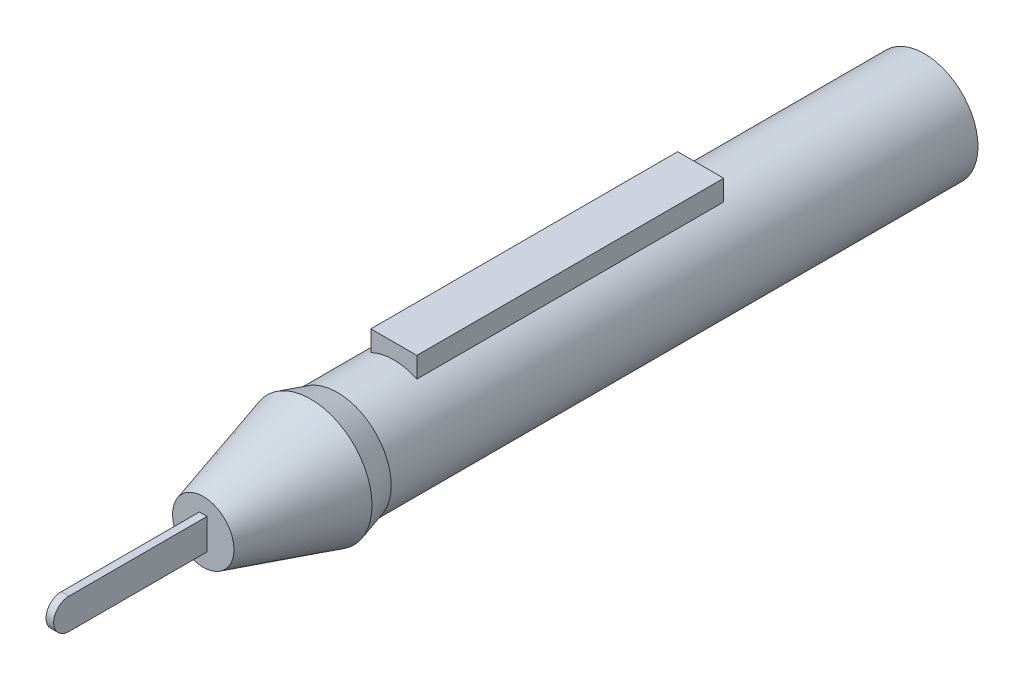
ISO-10303-21;
HEADER;
FILE_DESCRIPTION(('STEP AP214'),'2;1');
FILE_NAME('part.step','',(''),(''),'','','');
FILE_SCHEMA(('AUTOMOTIVE_DESIGN { 1 0 10303 214 1 1 1 1 }'));
ENDSEC;
DATA;
#1=APPLICATION_CONTEXT('core data for automotive mechanical design processes');
#2=APPLICATION_PROTOCOL_DEFINITION('international standard','automotive_design',2000,#1);
#3=PRODUCT_CONTEXT('',#1,'mechanical');
#4=PRODUCT('Part','Part','',(#3));
#5=PRODUCT_RELATED_PRODUCT_CATEGORY('part','',(#4));
#6=PRODUCT_DEFINITION_FORMATION('','',#4);
#7=PRODUCT_DEFINITION_CONTEXT('part definition',#1,'design');
#8=PRODUCT_DEFINITION('design','',#6,#7);
#9=PRODUCT_DEFINITION_SHAPE('','',#8);
#10=(LENGTH_UNIT() NAMED_UNIT(*) SI_UNIT(.MILLI.,.METRE.));
#11=(NAMED_UNIT(*) PLANE_ANGLE_UNIT() SI_UNIT($,.RADIAN.));
#12=(NAMED_UNIT(*) SI_UNIT($,.STERADIAN.) SOLID_ANGLE_UNIT());
#13=UNCERTAINTY_MEASURE_WITH_UNIT(LENGTH_MEASURE(1.E-05),#10,'distance_accuracy_value','');
#14=(GEOMETRIC_REPRESENTATION_CONTEXT(3) GLOBAL_UNCERTAINTY_ASSIGNED_CONTEXT((#13)) GLOBAL_UNIT_ASSIGNED_CONTEXT((#10,
#11,#12)) REPRESENTATION_CONTEXT('',''));
#15=CARTESIAN_POINT('',(0.,0.,0.));
#16=DIRECTION('',(0.,0.,1.));
#17=DIRECTION('',(1.,0.,0.));
#18=AXIS2_PLACEMENT_3D('',#15,#16,#17);
#19=CARTESIAN_POINT('',(0.,0.,-20.));
#20=DIRECTION('',(0.,0.,1.));
#21=DIRECTION('',(1.,0.,0.));
#22=AXIS2_PLACEMENT_3D('',#19,#20,#21);
#23=CYLINDRICAL_SURFACE('',#22,6.99807693751956);
#24=CARTESIAN_POINT('',(0.,0.,-114.));
#25=DIRECTION('',(0.,0.,1.));
#26=DIRECTION('',(1.,0.,0.));
#27=AXIS2_PLACEMENT_3D('',#24,#25,#26);
#28=CIRCLE('',#27,6.99807693751956);
#29=CARTESIAN_POINT('',(6.99807693751956,0.,-114.));
#30=VERTEX_POINT('',#29);
#31=EDGE_CURVE('E115',#30,#30,#28,.T.);
#32=ORIENTED_EDGE('',*,*,#31,.T.);
#33=EDGE_LOOP('',(#32));
#34=FACE_BOUND('',#33,.T.);
#35=CARTESIAN_POINT('',(0.,0.,-37.4950761371872));
#36=DIRECTION('',(0.,0.,1.));
#37=DIRECTION('',(1.,0.,0.));
#38=AXIS2_PLACEMENT_3D('',#35,#36,#37);
#39=CIRCLE('',#38,6.99807693751957);
#40=CARTESIAN_POINT('',(6.99807693751957,0.,-37.4950761371872));
#41=VERTEX_POINT('',#40);
#42=EDGE_CURVE('E118',#41,#41,#39,.T.);
#43=ORIENTED_EDGE('',*,*,#42,.F.);
#44=EDGE_LOOP('',(#43));
#45=FACE_BOUND('',#44,.T.);
#46=DIRECTION('',(0.,0.,1.));
#47=VECTOR('',#46,1.);
#48=CARTESIAN_POINT('',(-3.00000000000001,6.32242681439992,-20.));
#49=LINE('',#48,#47);
#50=CARTESIAN_POINT('',(-3.,6.32242681439993,-84.8472912605064));
#51=VERTEX_POINT('',#50);
#52=CARTESIAN_POINT('',(-3.,6.32242681439993,-44.8472912605064));
#53=VERTEX_POINT('',#52);
#54=EDGE_CURVE('E11',#51,#53,#49,.T.);
#55=ORIENTED_EDGE('',*,*,#54,.F.);
#56=CARTESIAN_POINT('',(0.,0.,-84.8472912605064));
#57=DIRECTION('',(0.,0.,1.));
#58=DIRECTION('',(1.,0.,0.));
#59=AXIS2_PLACEMENT_3D('',#56,#57,#58);
#60=CIRCLE('',#59,6.99807693751956);
#61=CARTESIAN_POINT('',(3.,6.32242681439993,-84.8472912605064));
#62=VERTEX_POINT('',#61);
#63=EDGE_CURVE('E163',#62,#51,#60,.T.);
#64=ORIENTED_EDGE('',*,*,#63,.F.);
#65=DIRECTION('',(0.,0.,1.));
#66=VECTOR('',#65,1.);
#67=CARTESIAN_POINT('',(3.00000000000001,6.32242681439992,-20.));
#68=LINE('',#67,#66);
#69=CARTESIAN_POINT('',(3.00000000000001,6.32242681439992,-44.8472912605064));
#70=VERTEX_POINT('',#69);
#71=EDGE_CURVE('E51',#70,#62,#68,.F.);
#72=ORIENTED_EDGE('',*,*,#71,.F.);
#73=CARTESIAN_POINT('',(0.,0.,-44.8472912605064));
#74=DIRECTION('',(0.,0.,-1.));
#75=DIRECTION('',(-1.,0.,0.));
#76=AXIS2_PLACEMENT_3D('',#73,#74,#75);
#77=CIRCLE('',#76,6.99807693751956);
#78=EDGE_CURVE('E41',#53,#70,#77,.T.);
#79=ORIENTED_EDGE('',*,*,#78,.F.);
#80=EDGE_LOOP('',(#55,#64,#72,#79));
#81=FACE_BOUND('',#80,.T.);
#82=ADVANCED_FACE('F33',(#34,#45,#81),#23,.T.);
#83=CARTESIAN_POINT('',(0.5,0.,-2.));
#84=DIRECTION('',(-1.,0.,0.));
#85=DIRECTION('',(0.,0.,1.));
#86=AXIS2_PLACEMENT_3D('',#83,#84,#85);
#87=CYLINDRICAL_SURFACE('',#86,2.);
#88=CARTESIAN_POINT('',(-0.5,0.,-2.));
#89=DIRECTION('',(1.,0.,0.));
#90=DIRECTION('',(0.,0.,1.));
#91=AXIS2_PLACEMENT_3D('',#88,#89,#90);
#92=CIRCLE('',#91,2.);
#93=CARTESIAN_POINT('',(-0.5,2.,-2.));
#94=VERTEX_POINT('',#93);
#95=CARTESIAN_POINT('',(-0.5,-2.,-2.));
#96=VERTEX_POINT('',#95);
#97=EDGE_CURVE('E132',#94,#96,#92,.T.);
#98=ORIENTED_EDGE('',*,*,#97,.T.);
#99=DIRECTION('',(-1.,0.,0.));
#100=VECTOR('',#99,1.);
#101=CARTESIAN_POINT('',(0.5,-2.,-2.));
#102=LINE('',#101,#100);
#103=CARTESIAN_POINT('',(0.5,-2.,-2.));
#104=VERTEX_POINT('',#103);
#105=EDGE_CURVE('E160',#104,#96,#102,.T.);
#106=ORIENTED_EDGE('',*,*,#105,.F.);
#107=CARTESIAN_POINT('',(0.5,0.,-2.));
#108=DIRECTION('',(1.,0.,0.));
#109=DIRECTION('',(0.,0.,1.));
#110=AXIS2_PLACEMENT_3D('',#107,#108,#109);
#111=CIRCLE('',#110,2.);
#112=CARTESIAN_POINT('',(0.5,2.,-2.));
#113=VERTEX_POINT('',#112);
#114=EDGE_CURVE('E133',#113,#104,#111,.T.);
#115=ORIENTED_EDGE('',*,*,#114,.F.);
#116=DIRECTION('',(-1.,0.,0.));
#117=VECTOR('',#116,1.);
#118=CARTESIAN_POINT('',(0.5,2.,-2.));
#119=LINE('',#118,#117);
#120=EDGE_CURVE('E143',#113,#94,#119,.T.);
#121=ORIENTED_EDGE('',*,*,#120,.T.);
#122=EDGE_LOOP('',(#98,#106,#115,#121));
#123=FACE_BOUND('',#122,.T.);
#124=ADVANCED_FACE('F35',(#123),#87,.T.);
#125=CARTESIAN_POINT('',(0.5,-2.,-2.));
#126=DIRECTION('',(0.,1.,0.));
#127=DIRECTION('',(0.,0.,1.));
#128=AXIS2_PLACEMENT_3D('',#125,#126,#127);
#129=PLANE('',#128);
#130=DIRECTION('',(0.,0.,-1.));
#131=VECTOR('',#130,1.);
#132=CARTESIAN_POINT('',(-0.5,-2.,-2.));
#133=LINE('',#132,#131);
#134=CARTESIAN_POINT('',(-0.5,-2.,-20.));
#135=VERTEX_POINT('',#134);
#136=EDGE_CURVE('E146',#96,#135,#133,.T.);
#137=ORIENTED_EDGE('',*,*,#136,.T.);
#138=DIRECTION('',(-1.,0.,0.));
#139=VECTOR('',#138,1.);
#140=CARTESIAN_POINT('',(0.5,-2.,-20.));
#141=LINE('',#140,#139);
#142=CARTESIAN_POINT('',(0.5,-2.,-20.));
#143=VERTEX_POINT('',#142);
#144=EDGE_CURVE('E157',#143,#135,#141,.T.);
#145=ORIENTED_EDGE('',*,*,#144,.F.);
#146=DIRECTION('',(0.,0.,-1.));
#147=VECTOR('',#146,1.);
#148=CARTESIAN_POINT('',(0.5,-2.,-2.));
#149=LINE('',#148,#147);
#150=EDGE_CURVE('E136',#104,#143,#149,.T.);
#151=ORIENTED_EDGE('',*,*,#150,.F.);
#152=ORIENTED_EDGE('',*,*,#105,.T.);
#153=EDGE_LOOP('',(#137,#145,#151,#152));
#154=FACE_BOUND('',#153,.T.);
#155=ADVANCED_FACE('F184',(#154),#129,.F.);
#156=CARTESIAN_POINT('',(0.5,2.,-2.));
#157=DIRECTION('',(0.,-1.,0.));
#158=DIRECTION('',(0.,0.,-1.));
#159=AXIS2_PLACEMENT_3D('',#156,#157,#158);
#160=PLANE('',#159);
#161=DIRECTION('',(0.,0.,1.));
#162=VECTOR('',#161,1.);
#163=CARTESIAN_POINT('',(-0.5,2.,-2.));
#164=LINE('',#163,#162);
#165=CARTESIAN_POINT('',(-0.5,2.,-20.));
#166=VERTEX_POINT('',#165);
#167=EDGE_CURVE('E137',#166,#94,#164,.T.);
#168=ORIENTED_EDGE('',*,*,#167,.T.);
#169=ORIENTED_EDGE('',*,*,#120,.F.);
#170=DIRECTION('',(0.,0.,1.));
#171=VECTOR('',#170,1.);
#172=CARTESIAN_POINT('',(0.5,2.,-2.));
#173=LINE('',#172,#171);
#174=CARTESIAN_POINT('',(0.5,2.,-20.));
#175=VERTEX_POINT('',#174);
#176=EDGE_CURVE('E141',#175,#113,#173,.T.);
#177=ORIENTED_EDGE('',*,*,#176,.F.);
#178=DIRECTION('',(-1.,0.,0.));
#179=VECTOR('',#178,1.);
#180=CARTESIAN_POINT('',(0.5,2.,-20.));
#181=LINE('',#180,#179);
#182=EDGE_CURVE('E154',#175,#166,#181,.T.);
#183=ORIENTED_EDGE('',*,*,#182,.T.);
#184=EDGE_LOOP('',(#168,#169,#177,#183));
#185=FACE_BOUND('',#184,.T.);
#186=ADVANCED_FACE('F206',(#185),#160,.F.);
#187=CARTESIAN_POINT('',(0.5,0.,-2.));
#188=DIRECTION('',(-1.,0.,0.));
#189=DIRECTION('',(0.,0.,1.));
#190=AXIS2_PLACEMENT_3D('',#187,#188,#189);
#191=PLANE('',#190);
#192=ORIENTED_EDGE('',*,*,#114,.T.);
#193=ORIENTED_EDGE('',*,*,#150,.T.);
#194=DIRECTION('',(0.,1.,0.));
#195=VECTOR('',#194,1.);
#196=CARTESIAN_POINT('',(0.5,2.,-20.));
#197=LINE('',#196,#195);
#198=EDGE_CURVE('E139',#143,#175,#197,.T.);
#199=ORIENTED_EDGE('',*,*,#198,.T.);
#200=ORIENTED_EDGE('',*,*,#176,.T.);
#201=EDGE_LOOP('',(#192,#193,#199,#200));
#202=FACE_BOUND('',#201,.T.);
#203=ADVANCED_FACE('F203',(#202),#191,.F.);
#204=CARTESIAN_POINT('',(-0.5,0.,-2.));
#205=DIRECTION('',(-1.,0.,0.));
#206=DIRECTION('',(0.,0.,1.));
#207=AXIS2_PLACEMENT_3D('',#204,#205,#206);
#208=PLANE('',#207);
#209=ORIENTED_EDGE('',*,*,#97,.F.);
#210=ORIENTED_EDGE('',*,*,#167,.F.);
#211=DIRECTION('',(0.,1.,0.));
#212=VECTOR('',#211,1.);
#213=CARTESIAN_POINT('',(-0.5,2.,-20.));
#214=LINE('',#213,#212);
#215=EDGE_CURVE('E148',#135,#166,#214,.T.);
#216=ORIENTED_EDGE('',*,*,#215,.F.);
#217=ORIENTED_EDGE('',*,*,#136,.F.);
#218=EDGE_LOOP('',(#209,#210,#216,#217));
#219=FACE_BOUND('',#218,.T.);
#220=ADVANCED_FACE('F201',(#219),#208,.T.);
#221=CARTESIAN_POINT('',(0.,0.,-20.));
#222=DIRECTION('',(0.,0.,-1.));
#223=DIRECTION('',(-1.,0.,0.));
#224=AXIS2_PLACEMENT_3D('',#221,#222,#223);
#225=PLANE('',#224);
#226=CARTESIAN_POINT('',(0.,0.,-20.));
#227=DIRECTION('',(0.,0.,1.));
#228=DIRECTION('',(1.,0.,0.));
#229=AXIS2_PLACEMENT_3D('',#226,#227,#228);
#230=CIRCLE('',#229,4.);
#231=CARTESIAN_POINT('',(4.,0.,-20.));
#232=VERTEX_POINT('',#231);
#233=EDGE_CURVE('E129',#232,#232,#230,.T.);
#234=ORIENTED_EDGE('',*,*,#233,.T.);
#235=EDGE_LOOP('',(#234));
#236=FACE_BOUND('',#235,.T.);
#237=ORIENTED_EDGE('',*,*,#182,.F.);
#238=ORIENTED_EDGE('',*,*,#198,.F.);
#239=ORIENTED_EDGE('',*,*,#144,.T.);
#240=ORIENTED_EDGE('',*,*,#215,.T.);
#241=EDGE_LOOP('',(#237,#238,#239,#240));
#242=FACE_BOUND('',#241,.T.);
#243=ADVANCED_FACE('F198',(#236,#242),#225,.F.);
#244=CARTESIAN_POINT('',(0.,0.,-34.));
#245=DIRECTION('',(0.,0.,-1.));
#246=DIRECTION('',(-1.,0.,0.));
#247=AXIS2_PLACEMENT_3D('',#244,#245,#246);
#248=CONICAL_SURFACE('',#247,8.,0.278299659005111);
#249=ORIENTED_EDGE('',*,*,#233,.F.);
#250=EDGE_LOOP('',(#249));
#251=FACE_BOUND('',#250,.T.);
#252=CARTESIAN_POINT('',(0.,0.,-34.));
#253=DIRECTION('',(0.,0.,1.));
#254=DIRECTION('',(1.,0.,0.));
#255=AXIS2_PLACEMENT_3D('',#252,#253,#254);
#256=CIRCLE('',#255,8.);
#257=CARTESIAN_POINT('',(8.,0.,-34.));
#258=VERTEX_POINT('',#257);
#259=EDGE_CURVE('E126',#258,#258,#256,.T.);
#260=ORIENTED_EDGE('',*,*,#259,.T.);
#261=EDGE_LOOP('',(#260));
#262=FACE_BOUND('',#261,.T.);
#263=ADVANCED_FACE('F194',(#251,#262),#248,.T.);
#264=CARTESIAN_POINT('',(0.,0.,-37.4950761371872));
#265=DIRECTION('',(0.,0.,1.));
#266=DIRECTION('',(1.,0.,0.));
#267=AXIS2_PLACEMENT_3D('',#264,#265,#266);
#268=CONICAL_SURFACE('',#267,6.99807693751957,0.279180267382372);
#269=ORIENTED_EDGE('',*,*,#259,.F.);
#270=EDGE_LOOP('',(#269));
#271=FACE_BOUND('',#270,.T.);
#272=ORIENTED_EDGE('',*,*,#42,.T.);
#273=EDGE_LOOP('',(#272));
#274=FACE_BOUND('',#273,.T.);
#275=ADVANCED_FACE('F191',(#271,#274),#268,.T.);
#276=CARTESIAN_POINT('',(0.,6.99807693751956,-114.));
#277=DIRECTION('',(0.,0.,1.));
#278=DIRECTION('',(1.,0.,0.));
#279=AXIS2_PLACEMENT_3D('',#276,#277,#278);
#280=PLANE('',#279);
#281=ORIENTED_EDGE('',*,*,#31,.F.);
#282=EDGE_LOOP('',(#281));
#283=FACE_BOUND('',#282,.T.);
#284=ADVANCED_FACE('F189',(#283),#280,.F.);
#285=CARTESIAN_POINT('',(-3.,9.,-84.8472912605064));
#286=DIRECTION('',(1.,0.,0.));
#287=DIRECTION('',(0.,0.,-1.));
#288=AXIS2_PLACEMENT_3D('',#285,#286,#287);
#289=PLANE('',#288);
#290=DIRECTION('',(0.,-1.,0.));
#291=VECTOR('',#290,1.);
#292=CARTESIAN_POINT('',(-3.,9.,-84.8472912605064));
#293=LINE('',#292,#291);
#294=CARTESIAN_POINT('',(-3.,9.,-84.8472912605064));
#295=VERTEX_POINT('',#294);
#296=EDGE_CURVE('E171',#295,#51,#293,.T.);
#297=ORIENTED_EDGE('',*,*,#296,.T.);
#298=ORIENTED_EDGE('',*,*,#54,.T.);
#299=DIRECTION('',(0.,-1.,0.));
#300=VECTOR('',#299,1.);
#301=CARTESIAN_POINT('',(-3.,9.,-44.8472912605064));
#302=LINE('',#301,#300);
#303=CARTESIAN_POINT('',(-3.,9.,-44.8472912605064));
#304=VERTEX_POINT('',#303);
#305=EDGE_CURVE('E98',#304,#53,#302,.T.);
#306=ORIENTED_EDGE('',*,*,#305,.F.);
#307=DIRECTION('',(0.,0.,1.));
#308=VECTOR('',#307,1.);
#309=CARTESIAN_POINT('',(-3.,9.,-84.8472912605064));
#310=LINE('',#309,#308);
#311=EDGE_CURVE('E104',#295,#304,#310,.T.);
#312=ORIENTED_EDGE('',*,*,#311,.F.);
#313=EDGE_LOOP('',(#297,#298,#306,#312));
#314=FACE_BOUND('',#313,.T.);
#315=ADVANCED_FACE('F114',(#314),#289,.F.);
#316=CARTESIAN_POINT('',(3.,9.,-84.8472912605064));
#317=DIRECTION('',(-1.,0.,0.));
#318=DIRECTION('',(0.,0.,1.));
#319=AXIS2_PLACEMENT_3D('',#316,#317,#318);
#320=PLANE('',#319);
#321=DIRECTION('',(0.,-1.,0.));
#322=VECTOR('',#321,1.);
#323=CARTESIAN_POINT('',(3.,9.,-44.8472912605064));
#324=LINE('',#323,#322);
#325=CARTESIAN_POINT('',(3.,9.,-44.8472912605064));
#326=VERTEX_POINT('',#325);
#327=EDGE_CURVE('E100',#326,#70,#324,.T.);
#328=ORIENTED_EDGE('',*,*,#327,.T.);
#329=ORIENTED_EDGE('',*,*,#71,.T.);
#330=DIRECTION('',(0.,-1.,0.));
#331=VECTOR('',#330,1.);
#332=CARTESIAN_POINT('',(3.,9.,-84.8472912605064));
#333=LINE('',#332,#331);
#334=CARTESIAN_POINT('',(3.,9.,-84.8472912605064));
#335=VERTEX_POINT('',#334);
#336=EDGE_CURVE('E120',#335,#62,#333,.T.);
#337=ORIENTED_EDGE('',*,*,#336,.F.);
#338=DIRECTION('',(0.,0.,-1.));
#339=VECTOR('',#338,1.);
#340=CARTESIAN_POINT('',(3.,9.,-84.8472912605064));
#341=LINE('',#340,#339);
#342=EDGE_CURVE('E103',#326,#335,#341,.T.);
#343=ORIENTED_EDGE('',*,*,#342,.F.);
#344=EDGE_LOOP('',(#328,#329,#337,#343));
#345=FACE_BOUND('',#344,.T.);
#346=ADVANCED_FACE('F167',(#345),#320,.F.);
#347=CARTESIAN_POINT('',(-3.,9.,-44.8472912605064));
#348=DIRECTION('',(0.,0.,-1.));
#349=DIRECTION('',(-1.,0.,0.));
#350=AXIS2_PLACEMENT_3D('',#347,#348,#349);
#351=PLANE('',#350);
#352=ORIENTED_EDGE('',*,*,#305,.T.);
#353=ORIENTED_EDGE('',*,*,#78,.T.);
#354=ORIENTED_EDGE('',*,*,#327,.F.);
#355=DIRECTION('',(1.,0.,0.));
#356=VECTOR('',#355,1.);
#357=CARTESIAN_POINT('',(-3.,9.,-44.8472912605064));
#358=LINE('',#357,#356);
#359=EDGE_CURVE('E94',#304,#326,#358,.T.);
#360=ORIENTED_EDGE('',*,*,#359,.F.);
#361=EDGE_LOOP('',(#352,#353,#354,#360));
#362=FACE_BOUND('',#361,.T.);
#363=ADVANCED_FACE('F96',(#362),#351,.F.);
#364=CARTESIAN_POINT('',(-3.,9.,-84.8472912605064));
#365=DIRECTION('',(0.,0.,1.));
#366=DIRECTION('',(1.,0.,0.));
#367=AXIS2_PLACEMENT_3D('',#364,#365,#366);
#368=PLANE('',#367);
#369=ORIENTED_EDGE('',*,*,#336,.T.);
#370=ORIENTED_EDGE('',*,*,#63,.T.);
#371=ORIENTED_EDGE('',*,*,#296,.F.);
#372=DIRECTION('',(-1.,0.,0.));
#373=VECTOR('',#372,1.);
#374=CARTESIAN_POINT('',(-3.,9.,-84.8472912605064));
#375=LINE('',#374,#373);
#376=EDGE_CURVE('E109',#335,#295,#375,.T.);
#377=ORIENTED_EDGE('',*,*,#376,.F.);
#378=EDGE_LOOP('',(#369,#370,#371,#377));
#379=FACE_BOUND('',#378,.T.);
#380=ADVANCED_FACE('F175',(#379),#368,.F.);
#381=CARTESIAN_POINT('',(0.,9.,0.));
#382=DIRECTION('',(0.,1.,0.));
#383=DIRECTION('',(0.,0.,1.));
#384=AXIS2_PLACEMENT_3D('',#381,#382,#383);
#385=PLANE('',#384);
#386=ORIENTED_EDGE('',*,*,#311,.T.);
#387=ORIENTED_EDGE('',*,*,#359,.T.);
#388=ORIENTED_EDGE('',*,*,#342,.T.);
#389=ORIENTED_EDGE('',*,*,#376,.T.);
#390=EDGE_LOOP('',(#386,#387,#388,#389));
#391=FACE_BOUND('',#390,.T.);
#392=ADVANCED_FACE('F107',(#391),#385,.T.);
#393=CLOSED_SHELL('',(#82,#124,#155,#186,#203,#220,#243,#263,#275,#284,#315,#346,#363,#380,#392));
#394=MANIFOLD_SOLID_BREP('B2',#393);
#395=ADVANCED_BREP_SHAPE_REPRESENTATION('',(#18,#394),#14);
#396=SHAPE_DEFINITION_REPRESENTATION(#9,#395);
ENDSEC;
END-ISO-10303-21;
